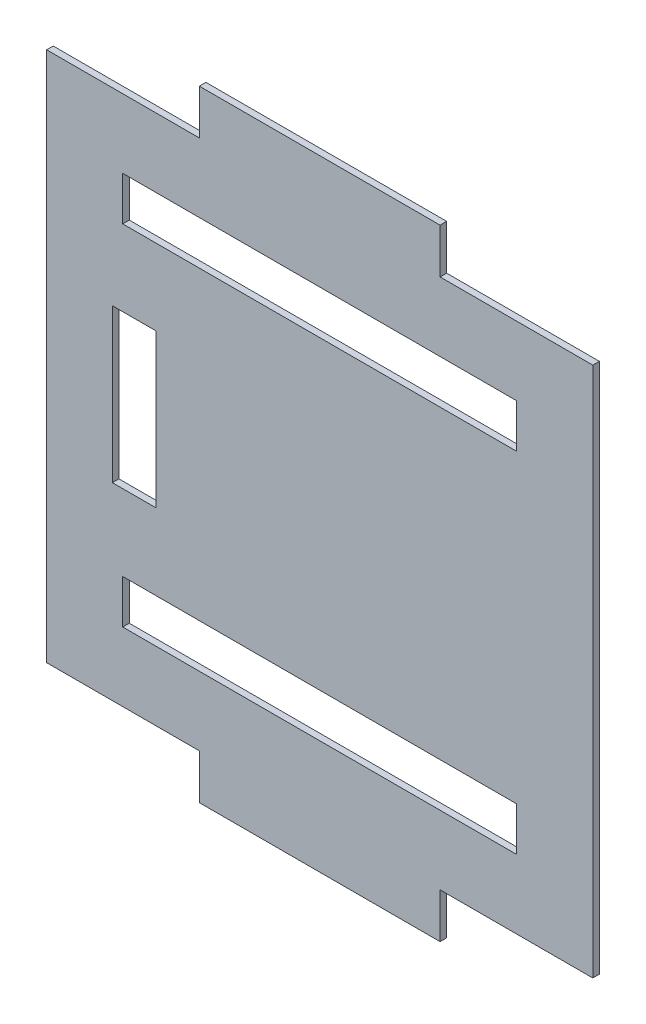
ISO-10303-21;
HEADER;
FILE_DESCRIPTION(('STEP AP214'),'2;1');
FILE_NAME('part.step','',(''),(''),'','','');
FILE_SCHEMA(('AUTOMOTIVE_DESIGN { 1 0 10303 214 1 1 1 1 }'));
ENDSEC;
DATA;
#1=APPLICATION_CONTEXT('core data for automotive mechanical design processes');
#2=APPLICATION_PROTOCOL_DEFINITION('international standard','automotive_design',2000,#1);
#3=PRODUCT_CONTEXT('',#1,'mechanical');
#4=PRODUCT('Part','Part','',(#3));
#5=PRODUCT_RELATED_PRODUCT_CATEGORY('part','',(#4));
#6=PRODUCT_DEFINITION_FORMATION('','',#4);
#7=PRODUCT_DEFINITION_CONTEXT('part definition',#1,'design');
#8=PRODUCT_DEFINITION('design','',#6,#7);
#9=PRODUCT_DEFINITION_SHAPE('','',#8);
#10=(LENGTH_UNIT() NAMED_UNIT(*) SI_UNIT(.MILLI.,.METRE.));
#11=(NAMED_UNIT(*) PLANE_ANGLE_UNIT() SI_UNIT($,.RADIAN.));
#12=(NAMED_UNIT(*) SI_UNIT($,.STERADIAN.) SOLID_ANGLE_UNIT());
#13=UNCERTAINTY_MEASURE_WITH_UNIT(LENGTH_MEASURE(1.E-05),#10,'distance_accuracy_value','');
#14=(GEOMETRIC_REPRESENTATION_CONTEXT(3) GLOBAL_UNCERTAINTY_ASSIGNED_CONTEXT((#13)) GLOBAL_UNIT_ASSIGNED_CONTEXT((#10,
#11,#12)) REPRESENTATION_CONTEXT('',''));
#15=CARTESIAN_POINT('',(0.,0.,0.));
#16=DIRECTION('',(0.,0.,1.));
#17=DIRECTION('',(1.,0.,0.));
#18=AXIS2_PLACEMENT_3D('',#15,#16,#17);
#19=CARTESIAN_POINT('',(24.7487373415291,284.748737341529,3.));
#20=DIRECTION('',(-1.,0.,0.));
#21=DIRECTION('',(0.,-1.,0.));
#22=AXIS2_PLACEMENT_3D('',#19,#20,#21);
#23=PLANE('',#22);
#24=DIRECTION('',(0.,1.,0.));
#25=VECTOR('',#24,1.);
#26=CARTESIAN_POINT('',(24.7487373415291,284.748737341529,0.));
#27=LINE('',#26,#25);
#28=CARTESIAN_POINT('',(24.7487373415291,33.5,0.));
#29=VERTEX_POINT('',#28);
#30=CARTESIAN_POINT('',(24.7487373415291,275.997474683058,0.));
#31=VERTEX_POINT('',#30);
#32=EDGE_CURVE('E334',#29,#31,#27,.T.);
#33=ORIENTED_EDGE('',*,*,#32,.T.);
#34=DIRECTION('',(0.,0.,1.));
#35=VECTOR('',#34,1.);
#36=CARTESIAN_POINT('',(24.7487373415291,275.997474683058,0.));
#37=LINE('',#36,#35);
#38=CARTESIAN_POINT('',(24.7487373415291,275.997474683058,3.));
#39=VERTEX_POINT('',#38);
#40=EDGE_CURVE('E335',#31,#39,#37,.T.);
#41=ORIENTED_EDGE('',*,*,#40,.T.);
#42=DIRECTION('',(0.,1.,0.));
#43=VECTOR('',#42,1.);
#44=CARTESIAN_POINT('',(24.7487373415291,284.748737341529,3.));
#45=LINE('',#44,#43);
#46=CARTESIAN_POINT('',(24.7487373415291,33.5,3.));
#47=VERTEX_POINT('',#46);
#48=EDGE_CURVE('E45',#47,#39,#45,.T.);
#49=ORIENTED_EDGE('',*,*,#48,.F.);
#50=DIRECTION('',(0.,0.,1.));
#51=VECTOR('',#50,1.);
#52=CARTESIAN_POINT('',(24.7487373415291,33.5,0.));
#53=LINE('',#52,#51);
#54=EDGE_CURVE('E345',#29,#47,#53,.T.);
#55=ORIENTED_EDGE('',*,*,#54,.F.);
#56=EDGE_LOOP('',(#33,#41,#49,#55));
#57=FACE_BOUND('',#56,.T.);
#58=ADVANCED_FACE('F37',(#57),#23,.F.);
#59=CARTESIAN_POINT('',(-224.748737341529,24.7487373415292,3.));
#60=DIRECTION('',(1.,0.,0.));
#61=DIRECTION('',(0.,1.,0.));
#62=AXIS2_PLACEMENT_3D('',#59,#60,#61);
#63=PLANE('',#62);
#64=DIRECTION('',(0.,-1.,0.));
#65=VECTOR('',#64,1.);
#66=CARTESIAN_POINT('',(-224.748737341529,24.7487373415292,3.));
#67=LINE('',#66,#65);
#68=CARTESIAN_POINT('',(-224.748737341529,275.997474683058,3.));
#69=VERTEX_POINT('',#68);
#70=CARTESIAN_POINT('',(-224.748737341529,33.5,3.));
#71=VERTEX_POINT('',#70);
#72=EDGE_CURVE('E11',#69,#71,#67,.T.);
#73=ORIENTED_EDGE('',*,*,#72,.F.);
#74=DIRECTION('',(0.,0.,1.));
#75=VECTOR('',#74,1.);
#76=CARTESIAN_POINT('',(-224.748737341529,275.997474683058,0.));
#77=LINE('',#76,#75);
#78=CARTESIAN_POINT('',(-224.748737341529,275.997474683058,0.));
#79=VERTEX_POINT('',#78);
#80=EDGE_CURVE('E332',#79,#69,#77,.T.);
#81=ORIENTED_EDGE('',*,*,#80,.F.);
#82=DIRECTION('',(0.,-1.,0.));
#83=VECTOR('',#82,1.);
#84=CARTESIAN_POINT('',(-224.748737341529,24.7487373415292,0.));
#85=LINE('',#84,#83);
#86=CARTESIAN_POINT('',(-224.748737341529,33.5,0.));
#87=VERTEX_POINT('',#86);
#88=EDGE_CURVE('E40',#79,#87,#85,.T.);
#89=ORIENTED_EDGE('',*,*,#88,.T.);
#90=DIRECTION('',(0.,0.,1.));
#91=VECTOR('',#90,1.);
#92=CARTESIAN_POINT('',(-224.748737341529,33.5,0.));
#93=LINE('',#92,#91);
#94=EDGE_CURVE('E235',#87,#71,#93,.T.);
#95=ORIENTED_EDGE('',*,*,#94,.T.);
#96=EDGE_LOOP('',(#73,#81,#89,#95));
#97=FACE_BOUND('',#96,.T.);
#98=ADVANCED_FACE('F395',(#97),#63,.F.);
#99=CARTESIAN_POINT('',(0.,0.,3.));
#100=DIRECTION('',(0.,0.,-1.));
#101=DIRECTION('',(-1.,0.,0.));
#102=AXIS2_PLACEMENT_3D('',#99,#100,#101);
#103=PLANE('',#102);
#104=DIRECTION('',(1.,0.,0.));
#105=VECTOR('',#104,1.);
#106=CARTESIAN_POINT('',(-190.,224.497474683058,3.));
#107=LINE('',#106,#105);
#108=CARTESIAN_POINT('',(-190.,224.497474683058,3.));
#109=VERTEX_POINT('',#108);
#110=CARTESIAN_POINT('',(-10.0000000000001,224.497474683058,3.));
#111=VERTEX_POINT('',#110);
#112=EDGE_CURVE('E229',#109,#111,#107,.T.);
#113=ORIENTED_EDGE('',*,*,#112,.F.);
#114=DIRECTION('',(0.,-1.,0.));
#115=VECTOR('',#114,1.);
#116=CARTESIAN_POINT('',(-190.,244.497474683058,3.));
#117=LINE('',#116,#115);
#118=CARTESIAN_POINT('',(-190.,244.497474683058,3.));
#119=VERTEX_POINT('',#118);
#120=EDGE_CURVE('E53',#119,#109,#117,.T.);
#121=ORIENTED_EDGE('',*,*,#120,.F.);
#122=DIRECTION('',(-1.,0.,0.));
#123=VECTOR('',#122,1.);
#124=CARTESIAN_POINT('',(-190.,244.497474683058,3.));
#125=LINE('',#124,#123);
#126=CARTESIAN_POINT('',(-10.,244.497474683058,3.));
#127=VERTEX_POINT('',#126);
#128=EDGE_CURVE('E220',#127,#119,#125,.T.);
#129=ORIENTED_EDGE('',*,*,#128,.F.);
#130=DIRECTION('',(0.,1.,0.));
#131=VECTOR('',#130,1.);
#132=CARTESIAN_POINT('',(-10.,244.497474683058,3.));
#133=LINE('',#132,#131);
#134=EDGE_CURVE('E223',#111,#127,#133,.T.);
#135=ORIENTED_EDGE('',*,*,#134,.F.);
#136=EDGE_LOOP('',(#113,#121,#129,#135));
#137=FACE_BOUND('',#136,.T.);
#138=DIRECTION('',(1.,0.,0.));
#139=VECTOR('',#138,1.);
#140=CARTESIAN_POINT('',(-194.748737341529,119.748737341529,3.));
#141=LINE('',#140,#139);
#142=CARTESIAN_POINT('',(-194.748737341529,119.748737341529,3.));
#143=VERTEX_POINT('',#142);
#144=CARTESIAN_POINT('',(-174.748737341529,119.748737341529,3.));
#145=VERTEX_POINT('',#144);
#146=EDGE_CURVE('E256',#143,#145,#141,.T.);
#147=ORIENTED_EDGE('',*,*,#146,.F.);
#148=DIRECTION('',(0.,-1.,0.));
#149=VECTOR('',#148,1.);
#150=CARTESIAN_POINT('',(-194.748737341529,189.748737341529,3.));
#151=LINE('',#150,#149);
#152=CARTESIAN_POINT('',(-194.748737341529,189.748737341529,3.));
#153=VERTEX_POINT('',#152);
#154=EDGE_CURVE('E61',#153,#143,#151,.T.);
#155=ORIENTED_EDGE('',*,*,#154,.F.);
#156=DIRECTION('',(-1.,0.,0.));
#157=VECTOR('',#156,1.);
#158=CARTESIAN_POINT('',(-194.748737341529,189.748737341529,3.));
#159=LINE('',#158,#157);
#160=CARTESIAN_POINT('',(-174.748737341529,189.748737341529,3.));
#161=VERTEX_POINT('',#160);
#162=EDGE_CURVE('E249',#161,#153,#159,.T.);
#163=ORIENTED_EDGE('',*,*,#162,.F.);
#164=DIRECTION('',(0.,1.,0.));
#165=VECTOR('',#164,1.);
#166=CARTESIAN_POINT('',(-174.748737341529,189.748737341529,3.));
#167=LINE('',#166,#165);
#168=EDGE_CURVE('E252',#145,#161,#167,.T.);
#169=ORIENTED_EDGE('',*,*,#168,.F.);
#170=EDGE_LOOP('',(#147,#155,#163,#169));
#171=FACE_BOUND('',#170,.T.);
#172=DIRECTION('',(0.,1.,0.));
#173=VECTOR('',#172,1.);
#174=CARTESIAN_POINT('',(-10.,65.0000000000001,3.));
#175=LINE('',#174,#173);
#176=CARTESIAN_POINT('',(-10.,65.0000000000001,3.));
#177=VERTEX_POINT('',#176);
#178=CARTESIAN_POINT('',(-10.,85.,3.));
#179=VERTEX_POINT('',#178);
#180=EDGE_CURVE('E287',#177,#179,#175,.T.);
#181=ORIENTED_EDGE('',*,*,#180,.F.);
#182=DIRECTION('',(1.,0.,0.));
#183=VECTOR('',#182,1.);
#184=CARTESIAN_POINT('',(-190.,65.,3.));
#185=LINE('',#184,#183);
#186=CARTESIAN_POINT('',(-190.,65.,3.));
#187=VERTEX_POINT('',#186);
#188=EDGE_CURVE('E248',#187,#177,#185,.T.);
#189=ORIENTED_EDGE('',*,*,#188,.F.);
#190=DIRECTION('',(0.,-1.,0.));
#191=VECTOR('',#190,1.);
#192=CARTESIAN_POINT('',(-190.,65.,3.));
#193=LINE('',#192,#191);
#194=CARTESIAN_POINT('',(-190.,85.,3.));
#195=VERTEX_POINT('',#194);
#196=EDGE_CURVE('E280',#195,#187,#193,.T.);
#197=ORIENTED_EDGE('',*,*,#196,.F.);
#198=DIRECTION('',(-1.,0.,0.));
#199=VECTOR('',#198,1.);
#200=CARTESIAN_POINT('',(-190.,85.,3.));
#201=LINE('',#200,#199);
#202=EDGE_CURVE('E283',#179,#195,#201,.T.);
#203=ORIENTED_EDGE('',*,*,#202,.F.);
#204=EDGE_LOOP('',(#181,#189,#197,#203));
#205=FACE_BOUND('',#204,.T.);
#206=DIRECTION('',(0.,1.,0.));
#207=VECTOR('',#206,1.);
#208=CARTESIAN_POINT('',(-155.,275.997474683058,3.));
#209=LINE('',#208,#207);
#210=CARTESIAN_POINT('',(-155.,275.997474683058,3.));
#211=VERTEX_POINT('',#210);
#212=CARTESIAN_POINT('',(-155.,296.497474683058,3.));
#213=VERTEX_POINT('',#212);
#214=EDGE_CURVE('E321',#211,#213,#209,.T.);
#215=ORIENTED_EDGE('',*,*,#214,.F.);
#216=DIRECTION('',(1.,0.,0.));
#217=VECTOR('',#216,1.);
#218=CARTESIAN_POINT('',(-224.748737341529,275.997474683058,3.));
#219=LINE('',#218,#217);
#220=EDGE_CURVE('E318',#69,#211,#219,.T.);
#221=ORIENTED_EDGE('',*,*,#220,.F.);
#222=ORIENTED_EDGE('',*,*,#72,.T.);
#223=DIRECTION('',(-1.,0.,0.));
#224=VECTOR('',#223,1.);
#225=CARTESIAN_POINT('',(-224.748737341529,33.5,3.));
#226=LINE('',#225,#224);
#227=CARTESIAN_POINT('',(-155.,33.5,3.));
#228=VERTEX_POINT('',#227);
#229=EDGE_CURVE('E358',#228,#71,#226,.T.);
#230=ORIENTED_EDGE('',*,*,#229,.F.);
#231=DIRECTION('',(0.,1.,0.));
#232=VECTOR('',#231,1.);
#233=CARTESIAN_POINT('',(-155.,33.5,3.));
#234=LINE('',#233,#232);
#235=CARTESIAN_POINT('',(-155.,13.0000000000001,3.));
#236=VERTEX_POINT('',#235);
#237=EDGE_CURVE('E360',#236,#228,#234,.T.);
#238=ORIENTED_EDGE('',*,*,#237,.F.);
#239=DIRECTION('',(-1.,0.,0.));
#240=VECTOR('',#239,1.);
#241=CARTESIAN_POINT('',(-45.,13.0000000000001,3.));
#242=LINE('',#241,#240);
#243=CARTESIAN_POINT('',(-45.,13.0000000000001,3.));
#244=VERTEX_POINT('',#243);
#245=EDGE_CURVE('E364',#244,#236,#242,.T.);
#246=ORIENTED_EDGE('',*,*,#245,.F.);
#247=DIRECTION('',(0.,-1.,0.));
#248=VECTOR('',#247,1.);
#249=CARTESIAN_POINT('',(-45.,13.0000000000001,3.));
#250=LINE('',#249,#248);
#251=CARTESIAN_POINT('',(-45.,33.5,3.));
#252=VERTEX_POINT('',#251);
#253=EDGE_CURVE('E367',#252,#244,#250,.T.);
#254=ORIENTED_EDGE('',*,*,#253,.F.);
#255=DIRECTION('',(-1.,0.,0.));
#256=VECTOR('',#255,1.);
#257=CARTESIAN_POINT('',(-45.,33.5,3.));
#258=LINE('',#257,#256);
#259=EDGE_CURVE('E322',#47,#252,#258,.T.);
#260=ORIENTED_EDGE('',*,*,#259,.F.);
#261=ORIENTED_EDGE('',*,*,#48,.T.);
#262=DIRECTION('',(1.,0.,0.));
#263=VECTOR('',#262,1.);
#264=CARTESIAN_POINT('',(-45.,275.997474683058,3.));
#265=LINE('',#264,#263);
#266=CARTESIAN_POINT('',(-45.,275.997474683058,3.));
#267=VERTEX_POINT('',#266);
#268=EDGE_CURVE('E305',#267,#39,#265,.T.);
#269=ORIENTED_EDGE('',*,*,#268,.F.);
#270=DIRECTION('',(0.,-1.,0.));
#271=VECTOR('',#270,1.);
#272=CARTESIAN_POINT('',(-45.,296.497474683058,3.));
#273=LINE('',#272,#271);
#274=CARTESIAN_POINT('',(-45.,296.497474683058,3.));
#275=VERTEX_POINT('',#274);
#276=EDGE_CURVE('E328',#275,#267,#273,.T.);
#277=ORIENTED_EDGE('',*,*,#276,.F.);
#278=DIRECTION('',(1.,0.,0.));
#279=VECTOR('',#278,1.);
#280=CARTESIAN_POINT('',(-45.,296.497474683058,3.));
#281=LINE('',#280,#279);
#282=EDGE_CURVE('E325',#213,#275,#281,.T.);
#283=ORIENTED_EDGE('',*,*,#282,.F.);
#284=EDGE_LOOP('',(#215,#221,#222,#230,#238,#246,#254,#260,#261,#269,#277,#283));
#285=FACE_BOUND('',#284,.T.);
#286=ADVANCED_FACE('F405',(#137,#171,#205,#285),#103,.F.);
#287=CARTESIAN_POINT('',(0.,0.,0.));
#288=DIRECTION('',(0.,0.,-1.));
#289=DIRECTION('',(-1.,0.,0.));
#290=AXIS2_PLACEMENT_3D('',#287,#288,#289);
#291=PLANE('',#290);
#292=DIRECTION('',(0.,-1.,0.));
#293=VECTOR('',#292,1.);
#294=CARTESIAN_POINT('',(-190.,244.497474683058,0.));
#295=LINE('',#294,#293);
#296=CARTESIAN_POINT('',(-190.,244.497474683058,0.));
#297=VERTEX_POINT('',#296);
#298=CARTESIAN_POINT('',(-190.,224.497474683058,0.));
#299=VERTEX_POINT('',#298);
#300=EDGE_CURVE('E201',#297,#299,#295,.T.);
#301=ORIENTED_EDGE('',*,*,#300,.T.);
#302=DIRECTION('',(1.,0.,0.));
#303=VECTOR('',#302,1.);
#304=CARTESIAN_POINT('',(-190.,224.497474683058,0.));
#305=LINE('',#304,#303);
#306=CARTESIAN_POINT('',(-10.0000000000001,224.497474683058,0.));
#307=VERTEX_POINT('',#306);
#308=EDGE_CURVE('E211',#299,#307,#305,.T.);
#309=ORIENTED_EDGE('',*,*,#308,.T.);
#310=DIRECTION('',(0.,1.,0.));
#311=VECTOR('',#310,1.);
#312=CARTESIAN_POINT('',(-10.,244.497474683058,0.));
#313=LINE('',#312,#311);
#314=CARTESIAN_POINT('',(-10.,244.497474683058,0.));
#315=VERTEX_POINT('',#314);
#316=EDGE_CURVE('E215',#307,#315,#313,.T.);
#317=ORIENTED_EDGE('',*,*,#316,.T.);
#318=DIRECTION('',(-1.,0.,0.));
#319=VECTOR('',#318,1.);
#320=CARTESIAN_POINT('',(-190.,244.497474683058,0.));
#321=LINE('',#320,#319);
#322=EDGE_CURVE('E207',#315,#297,#321,.T.);
#323=ORIENTED_EDGE('',*,*,#322,.T.);
#324=EDGE_LOOP('',(#301,#309,#317,#323));
#325=FACE_BOUND('',#324,.T.);
#326=DIRECTION('',(0.,-1.,0.));
#327=VECTOR('',#326,1.);
#328=CARTESIAN_POINT('',(-194.748737341529,189.748737341529,0.));
#329=LINE('',#328,#327);
#330=CARTESIAN_POINT('',(-194.748737341529,189.748737341529,0.));
#331=VERTEX_POINT('',#330);
#332=CARTESIAN_POINT('',(-194.748737341529,119.748737341529,0.));
#333=VERTEX_POINT('',#332);
#334=EDGE_CURVE('E253',#331,#333,#329,.T.);
#335=ORIENTED_EDGE('',*,*,#334,.T.);
#336=DIRECTION('',(1.,0.,0.));
#337=VECTOR('',#336,1.);
#338=CARTESIAN_POINT('',(-194.748737341529,119.748737341529,0.));
#339=LINE('',#338,#337);
#340=CARTESIAN_POINT('',(-174.748737341529,119.748737341529,0.));
#341=VERTEX_POINT('',#340);
#342=EDGE_CURVE('E265',#333,#341,#339,.T.);
#343=ORIENTED_EDGE('',*,*,#342,.T.);
#344=DIRECTION('',(0.,1.,0.));
#345=VECTOR('',#344,1.);
#346=CARTESIAN_POINT('',(-174.748737341529,189.748737341529,0.));
#347=LINE('',#346,#345);
#348=CARTESIAN_POINT('',(-174.748737341529,189.748737341529,0.));
#349=VERTEX_POINT('',#348);
#350=EDGE_CURVE('E262',#341,#349,#347,.T.);
#351=ORIENTED_EDGE('',*,*,#350,.T.);
#352=DIRECTION('',(-1.,0.,0.));
#353=VECTOR('',#352,1.);
#354=CARTESIAN_POINT('',(-194.748737341529,189.748737341529,0.));
#355=LINE('',#354,#353);
#356=EDGE_CURVE('E241',#349,#331,#355,.T.);
#357=ORIENTED_EDGE('',*,*,#356,.T.);
#358=EDGE_LOOP('',(#335,#343,#351,#357));
#359=FACE_BOUND('',#358,.T.);
#360=DIRECTION('',(1.,0.,0.));
#361=VECTOR('',#360,1.);
#362=CARTESIAN_POINT('',(-190.,65.,0.));
#363=LINE('',#362,#361);
#364=CARTESIAN_POINT('',(-190.,65.,0.));
#365=VERTEX_POINT('',#364);
#366=CARTESIAN_POINT('',(-10.,65.0000000000001,0.));
#367=VERTEX_POINT('',#366);
#368=EDGE_CURVE('E284',#365,#367,#363,.T.);
#369=ORIENTED_EDGE('',*,*,#368,.T.);
#370=DIRECTION('',(0.,1.,0.));
#371=VECTOR('',#370,1.);
#372=CARTESIAN_POINT('',(-10.,65.0000000000001,0.));
#373=LINE('',#372,#371);
#374=CARTESIAN_POINT('',(-10.,85.,0.));
#375=VERTEX_POINT('',#374);
#376=EDGE_CURVE('E296',#367,#375,#373,.T.);
#377=ORIENTED_EDGE('',*,*,#376,.T.);
#378=DIRECTION('',(-1.,0.,0.));
#379=VECTOR('',#378,1.);
#380=CARTESIAN_POINT('',(-190.,85.,0.));
#381=LINE('',#380,#379);
#382=CARTESIAN_POINT('',(-190.,85.,0.));
#383=VERTEX_POINT('',#382);
#384=EDGE_CURVE('E293',#375,#383,#381,.T.);
#385=ORIENTED_EDGE('',*,*,#384,.T.);
#386=DIRECTION('',(0.,-1.,0.));
#387=VECTOR('',#386,1.);
#388=CARTESIAN_POINT('',(-190.,65.,0.));
#389=LINE('',#388,#387);
#390=EDGE_CURVE('E273',#383,#365,#389,.T.);
#391=ORIENTED_EDGE('',*,*,#390,.T.);
#392=EDGE_LOOP('',(#369,#377,#385,#391));
#393=FACE_BOUND('',#392,.T.);
#394=DIRECTION('',(1.,0.,0.));
#395=VECTOR('',#394,1.);
#396=CARTESIAN_POINT('',(-224.748737341529,275.997474683058,0.));
#397=LINE('',#396,#395);
#398=CARTESIAN_POINT('',(-155.,275.997474683058,0.));
#399=VERTEX_POINT('',#398);
#400=EDGE_CURVE('E301',#79,#399,#397,.T.);
#401=ORIENTED_EDGE('',*,*,#400,.T.);
#402=DIRECTION('',(0.,1.,0.));
#403=VECTOR('',#402,1.);
#404=CARTESIAN_POINT('',(-155.,275.997474683058,0.));
#405=LINE('',#404,#403);
#406=CARTESIAN_POINT('',(-155.,296.497474683058,0.));
#407=VERTEX_POINT('',#406);
#408=EDGE_CURVE('E304',#399,#407,#405,.T.);
#409=ORIENTED_EDGE('',*,*,#408,.T.);
#410=DIRECTION('',(1.,0.,0.));
#411=VECTOR('',#410,1.);
#412=CARTESIAN_POINT('',(-45.,296.497474683058,0.));
#413=LINE('',#412,#411);
#414=CARTESIAN_POINT('',(-45.,296.497474683058,0.));
#415=VERTEX_POINT('',#414);
#416=EDGE_CURVE('E308',#407,#415,#413,.T.);
#417=ORIENTED_EDGE('',*,*,#416,.T.);
#418=DIRECTION('',(0.,-1.,0.));
#419=VECTOR('',#418,1.);
#420=CARTESIAN_POINT('',(-45.,296.497474683058,0.));
#421=LINE('',#420,#419);
#422=CARTESIAN_POINT('',(-45.,275.997474683058,0.));
#423=VERTEX_POINT('',#422);
#424=EDGE_CURVE('E311',#415,#423,#421,.T.);
#425=ORIENTED_EDGE('',*,*,#424,.T.);
#426=DIRECTION('',(1.,0.,0.));
#427=VECTOR('',#426,1.);
#428=CARTESIAN_POINT('',(-45.,275.997474683058,0.));
#429=LINE('',#428,#427);
#430=EDGE_CURVE('E314',#423,#31,#429,.T.);
#431=ORIENTED_EDGE('',*,*,#430,.T.);
#432=ORIENTED_EDGE('',*,*,#32,.F.);
#433=DIRECTION('',(-1.,0.,0.));
#434=VECTOR('',#433,1.);
#435=CARTESIAN_POINT('',(-45.,33.5,0.));
#436=LINE('',#435,#434);
#437=CARTESIAN_POINT('',(-45.,33.5,0.));
#438=VERTEX_POINT('',#437);
#439=EDGE_CURVE('E361',#29,#438,#436,.T.);
#440=ORIENTED_EDGE('',*,*,#439,.T.);
#441=DIRECTION('',(0.,-1.,0.));
#442=VECTOR('',#441,1.);
#443=CARTESIAN_POINT('',(-45.,13.0000000000001,0.));
#444=LINE('',#443,#442);
#445=CARTESIAN_POINT('',(-45.,13.0000000000001,0.));
#446=VERTEX_POINT('',#445);
#447=EDGE_CURVE('E380',#438,#446,#444,.T.);
#448=ORIENTED_EDGE('',*,*,#447,.T.);
#449=DIRECTION('',(-1.,0.,0.));
#450=VECTOR('',#449,1.);
#451=CARTESIAN_POINT('',(-45.,13.0000000000001,0.));
#452=LINE('',#451,#450);
#453=CARTESIAN_POINT('',(-155.,13.0000000000001,0.));
#454=VERTEX_POINT('',#453);
#455=EDGE_CURVE('E377',#446,#454,#452,.T.);
#456=ORIENTED_EDGE('',*,*,#455,.T.);
#457=DIRECTION('',(0.,1.,0.));
#458=VECTOR('',#457,1.);
#459=CARTESIAN_POINT('',(-155.,33.5,0.));
#460=LINE('',#459,#458);
#461=CARTESIAN_POINT('',(-155.,33.5,0.));
#462=VERTEX_POINT('',#461);
#463=EDGE_CURVE('E374',#454,#462,#460,.T.);
#464=ORIENTED_EDGE('',*,*,#463,.T.);
#465=DIRECTION('',(-1.,0.,0.));
#466=VECTOR('',#465,1.);
#467=CARTESIAN_POINT('',(-224.748737341529,33.5,0.));
#468=LINE('',#467,#466);
#469=EDGE_CURVE('E347',#462,#87,#468,.T.);
#470=ORIENTED_EDGE('',*,*,#469,.T.);
#471=ORIENTED_EDGE('',*,*,#88,.F.);
#472=EDGE_LOOP('',(#401,#409,#417,#425,#431,#432,#440,#448,#456,#464,#470,#471));
#473=FACE_BOUND('',#472,.T.);
#474=ADVANCED_FACE('F217',(#325,#359,#393,#473),#291,.T.);
#475=CARTESIAN_POINT('',(-224.748737341529,33.5,0.));
#476=DIRECTION('',(0.,1.,0.));
#477=DIRECTION('',(0.,0.,1.));
#478=AXIS2_PLACEMENT_3D('',#475,#476,#477);
#479=PLANE('',#478);
#480=ORIENTED_EDGE('',*,*,#229,.T.);
#481=ORIENTED_EDGE('',*,*,#94,.F.);
#482=ORIENTED_EDGE('',*,*,#469,.F.);
#483=DIRECTION('',(0.,0.,1.));
#484=VECTOR('',#483,1.);
#485=CARTESIAN_POINT('',(-155.,33.5,0.));
#486=LINE('',#485,#484);
#487=EDGE_CURVE('E354',#462,#228,#486,.T.);
#488=ORIENTED_EDGE('',*,*,#487,.T.);
#489=EDGE_LOOP('',(#480,#481,#482,#488));
#490=FACE_BOUND('',#489,.T.);
#491=ADVANCED_FACE('F400',(#490),#479,.F.);
#492=CARTESIAN_POINT('',(-155.,33.5,0.));
#493=DIRECTION('',(1.,0.,0.));
#494=DIRECTION('',(0.,1.,0.));
#495=AXIS2_PLACEMENT_3D('',#492,#493,#494);
#496=PLANE('',#495);
#497=ORIENTED_EDGE('',*,*,#237,.T.);
#498=ORIENTED_EDGE('',*,*,#487,.F.);
#499=ORIENTED_EDGE('',*,*,#463,.F.);
#500=DIRECTION('',(0.,0.,1.));
#501=VECTOR('',#500,1.);
#502=CARTESIAN_POINT('',(-155.,13.0000000000001,0.));
#503=LINE('',#502,#501);
#504=EDGE_CURVE('E352',#454,#236,#503,.T.);
#505=ORIENTED_EDGE('',*,*,#504,.T.);
#506=EDGE_LOOP('',(#497,#498,#499,#505));
#507=FACE_BOUND('',#506,.T.);
#508=ADVANCED_FACE('F437',(#507),#496,.F.);
#509=CARTESIAN_POINT('',(-45.,13.0000000000001,0.));
#510=DIRECTION('',(0.,1.,0.));
#511=DIRECTION('',(-1.,0.,0.));
#512=AXIS2_PLACEMENT_3D('',#509,#510,#511);
#513=PLANE('',#512);
#514=ORIENTED_EDGE('',*,*,#245,.T.);
#515=ORIENTED_EDGE('',*,*,#504,.F.);
#516=ORIENTED_EDGE('',*,*,#455,.F.);
#517=DIRECTION('',(0.,0.,1.));
#518=VECTOR('',#517,1.);
#519=CARTESIAN_POINT('',(-45.,13.0000000000001,0.));
#520=LINE('',#519,#518);
#521=EDGE_CURVE('E350',#446,#244,#520,.T.);
#522=ORIENTED_EDGE('',*,*,#521,.T.);
#523=EDGE_LOOP('',(#514,#515,#516,#522));
#524=FACE_BOUND('',#523,.T.);
#525=ADVANCED_FACE('F435',(#524),#513,.F.);
#526=CARTESIAN_POINT('',(-45.,13.0000000000001,0.));
#527=DIRECTION('',(-1.,0.,0.));
#528=DIRECTION('',(0.,-1.,0.));
#529=AXIS2_PLACEMENT_3D('',#526,#527,#528);
#530=PLANE('',#529);
#531=ORIENTED_EDGE('',*,*,#253,.T.);
#532=ORIENTED_EDGE('',*,*,#521,.F.);
#533=ORIENTED_EDGE('',*,*,#447,.F.);
#534=DIRECTION('',(0.,0.,1.));
#535=VECTOR('',#534,1.);
#536=CARTESIAN_POINT('',(-45.,33.5,0.));
#537=LINE('',#536,#535);
#538=EDGE_CURVE('E348',#438,#252,#537,.T.);
#539=ORIENTED_EDGE('',*,*,#538,.T.);
#540=EDGE_LOOP('',(#531,#532,#533,#539));
#541=FACE_BOUND('',#540,.T.);
#542=ADVANCED_FACE('F432',(#541),#530,.F.);
#543=CARTESIAN_POINT('',(-45.,33.5,0.));
#544=DIRECTION('',(0.,1.,0.));
#545=DIRECTION('',(0.,0.,1.));
#546=AXIS2_PLACEMENT_3D('',#543,#544,#545);
#547=PLANE('',#546);
#548=ORIENTED_EDGE('',*,*,#259,.T.);
#549=ORIENTED_EDGE('',*,*,#538,.F.);
#550=ORIENTED_EDGE('',*,*,#439,.F.);
#551=ORIENTED_EDGE('',*,*,#54,.T.);
#552=EDGE_LOOP('',(#548,#549,#550,#551));
#553=FACE_BOUND('',#552,.T.);
#554=ADVANCED_FACE('F427',(#553),#547,.F.);
#555=CARTESIAN_POINT('',(-224.748737341529,275.997474683058,0.));
#556=DIRECTION('',(0.,-1.,0.));
#557=DIRECTION('',(0.,0.,-1.));
#558=AXIS2_PLACEMENT_3D('',#555,#556,#557);
#559=PLANE('',#558);
#560=ORIENTED_EDGE('',*,*,#220,.T.);
#561=DIRECTION('',(0.,0.,1.));
#562=VECTOR('',#561,1.);
#563=CARTESIAN_POINT('',(-155.,275.997474683058,0.));
#564=LINE('',#563,#562);
#565=EDGE_CURVE('E317',#399,#211,#564,.T.);
#566=ORIENTED_EDGE('',*,*,#565,.F.);
#567=ORIENTED_EDGE('',*,*,#400,.F.);
#568=ORIENTED_EDGE('',*,*,#80,.T.);
#569=EDGE_LOOP('',(#560,#566,#567,#568));
#570=FACE_BOUND('',#569,.T.);
#571=ADVANCED_FACE('F410',(#570),#559,.F.);
#572=CARTESIAN_POINT('',(-45.,275.997474683058,0.));
#573=DIRECTION('',(0.,-1.,0.));
#574=DIRECTION('',(0.,0.,-1.));
#575=AXIS2_PLACEMENT_3D('',#572,#573,#574);
#576=PLANE('',#575);
#577=ORIENTED_EDGE('',*,*,#268,.T.);
#578=ORIENTED_EDGE('',*,*,#40,.F.);
#579=ORIENTED_EDGE('',*,*,#430,.F.);
#580=DIRECTION('',(0.,0.,1.));
#581=VECTOR('',#580,1.);
#582=CARTESIAN_POINT('',(-45.,275.997474683058,0.));
#583=LINE('',#582,#581);
#584=EDGE_CURVE('E338',#423,#267,#583,.T.);
#585=ORIENTED_EDGE('',*,*,#584,.T.);
#586=EDGE_LOOP('',(#577,#578,#579,#585));
#587=FACE_BOUND('',#586,.T.);
#588=ADVANCED_FACE('F424',(#587),#576,.F.);
#589=CARTESIAN_POINT('',(-45.,296.497474683058,0.));
#590=DIRECTION('',(-1.,0.,0.));
#591=DIRECTION('',(0.,-1.,0.));
#592=AXIS2_PLACEMENT_3D('',#589,#590,#591);
#593=PLANE('',#592);
#594=ORIENTED_EDGE('',*,*,#276,.T.);
#595=ORIENTED_EDGE('',*,*,#584,.F.);
#596=ORIENTED_EDGE('',*,*,#424,.F.);
#597=DIRECTION('',(0.,0.,1.));
#598=VECTOR('',#597,1.);
#599=CARTESIAN_POINT('',(-45.,296.497474683058,0.));
#600=LINE('',#599,#598);
#601=EDGE_CURVE('E340',#415,#275,#600,.T.);
#602=ORIENTED_EDGE('',*,*,#601,.T.);
#603=EDGE_LOOP('',(#594,#595,#596,#602));
#604=FACE_BOUND('',#603,.T.);
#605=ADVANCED_FACE('F420',(#604),#593,.F.);
#606=CARTESIAN_POINT('',(-45.,296.497474683058,0.));
#607=DIRECTION('',(0.,-1.,0.));
#608=DIRECTION('',(0.,0.,-1.));
#609=AXIS2_PLACEMENT_3D('',#606,#607,#608);
#610=PLANE('',#609);
#611=ORIENTED_EDGE('',*,*,#282,.T.);
#612=ORIENTED_EDGE('',*,*,#601,.F.);
#613=ORIENTED_EDGE('',*,*,#416,.F.);
#614=DIRECTION('',(0.,0.,1.));
#615=VECTOR('',#614,1.);
#616=CARTESIAN_POINT('',(-155.,296.497474683058,0.));
#617=LINE('',#616,#615);
#618=EDGE_CURVE('E342',#407,#213,#617,.T.);
#619=ORIENTED_EDGE('',*,*,#618,.T.);
#620=EDGE_LOOP('',(#611,#612,#613,#619));
#621=FACE_BOUND('',#620,.T.);
#622=ADVANCED_FACE('F417',(#621),#610,.F.);
#623=CARTESIAN_POINT('',(-155.,275.997474683058,0.));
#624=DIRECTION('',(1.,0.,0.));
#625=DIRECTION('',(0.,1.,0.));
#626=AXIS2_PLACEMENT_3D('',#623,#624,#625);
#627=PLANE('',#626);
#628=ORIENTED_EDGE('',*,*,#214,.T.);
#629=ORIENTED_EDGE('',*,*,#618,.F.);
#630=ORIENTED_EDGE('',*,*,#408,.F.);
#631=ORIENTED_EDGE('',*,*,#565,.T.);
#632=EDGE_LOOP('',(#628,#629,#630,#631));
#633=FACE_BOUND('',#632,.T.);
#634=ADVANCED_FACE('F414',(#633),#627,.F.);
#635=CARTESIAN_POINT('',(-190.,65.,0.));
#636=DIRECTION('',(0.,-1.,0.));
#637=DIRECTION('',(1.,0.,0.));
#638=AXIS2_PLACEMENT_3D('',#635,#636,#637);
#639=PLANE('',#638);
#640=ORIENTED_EDGE('',*,*,#188,.T.);
#641=DIRECTION('',(0.,0.,1.));
#642=VECTOR('',#641,1.);
#643=CARTESIAN_POINT('',(-10.,65.0000000000001,0.));
#644=LINE('',#643,#642);
#645=EDGE_CURVE('E270',#367,#177,#644,.T.);
#646=ORIENTED_EDGE('',*,*,#645,.F.);
#647=ORIENTED_EDGE('',*,*,#368,.F.);
#648=DIRECTION('',(0.,0.,1.));
#649=VECTOR('',#648,1.);
#650=CARTESIAN_POINT('',(-190.,65.,0.));
#651=LINE('',#650,#649);
#652=EDGE_CURVE('E278',#365,#187,#651,.T.);
#653=ORIENTED_EDGE('',*,*,#652,.T.);
#654=EDGE_LOOP('',(#640,#646,#647,#653));
#655=FACE_BOUND('',#654,.T.);
#656=ADVANCED_FACE('F543',(#655),#639,.F.);
#657=CARTESIAN_POINT('',(-190.,65.,0.));
#658=DIRECTION('',(-1.,0.,0.));
#659=DIRECTION('',(0.,-1.,0.));
#660=AXIS2_PLACEMENT_3D('',#657,#658,#659);
#661=PLANE('',#660);
#662=ORIENTED_EDGE('',*,*,#196,.T.);
#663=ORIENTED_EDGE('',*,*,#652,.F.);
#664=ORIENTED_EDGE('',*,*,#390,.F.);
#665=DIRECTION('',(0.,0.,1.));
#666=VECTOR('',#665,1.);
#667=CARTESIAN_POINT('',(-190.,85.,0.));
#668=LINE('',#667,#666);
#669=EDGE_CURVE('E276',#383,#195,#668,.T.);
#670=ORIENTED_EDGE('',*,*,#669,.T.);
#671=EDGE_LOOP('',(#662,#663,#664,#670));
#672=FACE_BOUND('',#671,.T.);
#673=ADVANCED_FACE('F578',(#672),#661,.F.);
#674=CARTESIAN_POINT('',(-190.,85.,0.));
#675=DIRECTION('',(0.,1.,0.));
#676=DIRECTION('',(-1.,0.,0.));
#677=AXIS2_PLACEMENT_3D('',#674,#675,#676);
#678=PLANE('',#677);
#679=ORIENTED_EDGE('',*,*,#202,.T.);
#680=ORIENTED_EDGE('',*,*,#669,.F.);
#681=ORIENTED_EDGE('',*,*,#384,.F.);
#682=DIRECTION('',(0.,0.,1.));
#683=VECTOR('',#682,1.);
#684=CARTESIAN_POINT('',(-10.,85.,0.));
#685=LINE('',#684,#683);
#686=EDGE_CURVE('E274',#375,#179,#685,.T.);
#687=ORIENTED_EDGE('',*,*,#686,.T.);
#688=EDGE_LOOP('',(#679,#680,#681,#687));
#689=FACE_BOUND('',#688,.T.);
#690=ADVANCED_FACE('F587',(#689),#678,.F.);
#691=CARTESIAN_POINT('',(-10.,65.0000000000001,0.));
#692=DIRECTION('',(1.,0.,0.));
#693=DIRECTION('',(0.,1.,0.));
#694=AXIS2_PLACEMENT_3D('',#691,#692,#693);
#695=PLANE('',#694);
#696=ORIENTED_EDGE('',*,*,#180,.T.);
#697=ORIENTED_EDGE('',*,*,#686,.F.);
#698=ORIENTED_EDGE('',*,*,#376,.F.);
#699=ORIENTED_EDGE('',*,*,#645,.T.);
#700=EDGE_LOOP('',(#696,#697,#698,#699));
#701=FACE_BOUND('',#700,.T.);
#702=ADVANCED_FACE('F597',(#701),#695,.F.);
#703=CARTESIAN_POINT('',(-194.748737341529,189.748737341529,0.));
#704=DIRECTION('',(-1.,0.,0.));
#705=DIRECTION('',(0.,0.,1.));
#706=AXIS2_PLACEMENT_3D('',#703,#704,#705);
#707=PLANE('',#706);
#708=ORIENTED_EDGE('',*,*,#154,.T.);
#709=DIRECTION('',(0.,0.,1.));
#710=VECTOR('',#709,1.);
#711=CARTESIAN_POINT('',(-194.748737341529,119.748737341529,0.));
#712=LINE('',#711,#710);
#713=EDGE_CURVE('E239',#333,#143,#712,.T.);
#714=ORIENTED_EDGE('',*,*,#713,.F.);
#715=ORIENTED_EDGE('',*,*,#334,.F.);
#716=DIRECTION('',(0.,0.,1.));
#717=VECTOR('',#716,1.);
#718=CARTESIAN_POINT('',(-194.748737341529,189.748737341529,0.));
#719=LINE('',#718,#717);
#720=EDGE_CURVE('E246',#331,#153,#719,.T.);
#721=ORIENTED_EDGE('',*,*,#720,.T.);
#722=EDGE_LOOP('',(#708,#714,#715,#721));
#723=FACE_BOUND('',#722,.T.);
#724=ADVANCED_FACE('F607',(#723),#707,.F.);
#725=CARTESIAN_POINT('',(-194.748737341529,189.748737341529,0.));
#726=DIRECTION('',(0.,1.,0.));
#727=DIRECTION('',(0.,0.,1.));
#728=AXIS2_PLACEMENT_3D('',#725,#726,#727);
#729=PLANE('',#728);
#730=ORIENTED_EDGE('',*,*,#162,.T.);
#731=ORIENTED_EDGE('',*,*,#720,.F.);
#732=ORIENTED_EDGE('',*,*,#356,.F.);
#733=DIRECTION('',(0.,0.,1.));
#734=VECTOR('',#733,1.);
#735=CARTESIAN_POINT('',(-174.748737341529,189.748737341529,0.));
#736=LINE('',#735,#734);
#737=EDGE_CURVE('E244',#349,#161,#736,.T.);
#738=ORIENTED_EDGE('',*,*,#737,.T.);
#739=EDGE_LOOP('',(#730,#731,#732,#738));
#740=FACE_BOUND('',#739,.T.);
#741=ADVANCED_FACE('F617',(#740),#729,.F.);
#742=CARTESIAN_POINT('',(-174.748737341529,189.748737341529,0.));
#743=DIRECTION('',(1.,0.,0.));
#744=DIRECTION('',(0.,0.,-1.));
#745=AXIS2_PLACEMENT_3D('',#742,#743,#744);
#746=PLANE('',#745);
#747=ORIENTED_EDGE('',*,*,#168,.T.);
#748=ORIENTED_EDGE('',*,*,#737,.F.);
#749=ORIENTED_EDGE('',*,*,#350,.F.);
#750=DIRECTION('',(0.,0.,1.));
#751=VECTOR('',#750,1.);
#752=CARTESIAN_POINT('',(-174.748737341529,119.748737341529,0.));
#753=LINE('',#752,#751);
#754=EDGE_CURVE('E242',#341,#145,#753,.T.);
#755=ORIENTED_EDGE('',*,*,#754,.T.);
#756=EDGE_LOOP('',(#747,#748,#749,#755));
#757=FACE_BOUND('',#756,.T.);
#758=ADVANCED_FACE('F626',(#757),#746,.F.);
#759=CARTESIAN_POINT('',(-194.748737341529,119.748737341529,0.));
#760=DIRECTION('',(0.,-1.,0.));
#761=DIRECTION('',(0.,0.,-1.));
#762=AXIS2_PLACEMENT_3D('',#759,#760,#761);
#763=PLANE('',#762);
#764=ORIENTED_EDGE('',*,*,#146,.T.);
#765=ORIENTED_EDGE('',*,*,#754,.F.);
#766=ORIENTED_EDGE('',*,*,#342,.F.);
#767=ORIENTED_EDGE('',*,*,#713,.T.);
#768=EDGE_LOOP('',(#764,#765,#766,#767));
#769=FACE_BOUND('',#768,.T.);
#770=ADVANCED_FACE('F636',(#769),#763,.F.);
#771=CARTESIAN_POINT('',(-190.,244.497474683058,0.));
#772=DIRECTION('',(-1.,0.,0.));
#773=DIRECTION('',(0.,-1.,0.));
#774=AXIS2_PLACEMENT_3D('',#771,#772,#773);
#775=PLANE('',#774);
#776=ORIENTED_EDGE('',*,*,#120,.T.);
#777=DIRECTION('',(0.,0.,1.));
#778=VECTOR('',#777,1.);
#779=CARTESIAN_POINT('',(-190.,224.497474683058,0.));
#780=LINE('',#779,#778);
#781=EDGE_CURVE('E197',#299,#109,#780,.T.);
#782=ORIENTED_EDGE('',*,*,#781,.F.);
#783=ORIENTED_EDGE('',*,*,#300,.F.);
#784=DIRECTION('',(0.,0.,1.));
#785=VECTOR('',#784,1.);
#786=CARTESIAN_POINT('',(-190.,244.497474683058,0.));
#787=LINE('',#786,#785);
#788=EDGE_CURVE('E233',#297,#119,#787,.T.);
#789=ORIENTED_EDGE('',*,*,#788,.T.);
#790=EDGE_LOOP('',(#776,#782,#783,#789));
#791=FACE_BOUND('',#790,.T.);
#792=ADVANCED_FACE('F199',(#791),#775,.F.);
#793=CARTESIAN_POINT('',(-190.,244.497474683058,0.));
#794=DIRECTION('',(0.,1.,0.));
#795=DIRECTION('',(-1.,0.,0.));
#796=AXIS2_PLACEMENT_3D('',#793,#794,#795);
#797=PLANE('',#796);
#798=ORIENTED_EDGE('',*,*,#128,.T.);
#799=ORIENTED_EDGE('',*,*,#788,.F.);
#800=ORIENTED_EDGE('',*,*,#322,.F.);
#801=DIRECTION('',(0.,0.,1.));
#802=VECTOR('',#801,1.);
#803=CARTESIAN_POINT('',(-10.,244.497474683058,0.));
#804=LINE('',#803,#802);
#805=EDGE_CURVE('E236',#315,#127,#804,.T.);
#806=ORIENTED_EDGE('',*,*,#805,.T.);
#807=EDGE_LOOP('',(#798,#799,#800,#806));
#808=FACE_BOUND('',#807,.T.);
#809=ADVANCED_FACE('F655',(#808),#797,.F.);
#810=CARTESIAN_POINT('',(-10.,244.497474683058,0.));
#811=DIRECTION('',(1.,0.,0.));
#812=DIRECTION('',(0.,1.,0.));
#813=AXIS2_PLACEMENT_3D('',#810,#811,#812);
#814=PLANE('',#813);
#815=ORIENTED_EDGE('',*,*,#134,.T.);
#816=ORIENTED_EDGE('',*,*,#805,.F.);
#817=ORIENTED_EDGE('',*,*,#316,.F.);
#818=DIRECTION('',(0.,0.,1.));
#819=VECTOR('',#818,1.);
#820=CARTESIAN_POINT('',(-10.0000000000001,224.497474683058,0.));
#821=LINE('',#820,#819);
#822=EDGE_CURVE('E206',#307,#111,#821,.T.);
#823=ORIENTED_EDGE('',*,*,#822,.T.);
#824=EDGE_LOOP('',(#815,#816,#817,#823));
#825=FACE_BOUND('',#824,.T.);
#826=ADVANCED_FACE('F664',(#825),#814,.F.);
#827=CARTESIAN_POINT('',(-190.,224.497474683058,0.));
#828=DIRECTION('',(0.,-1.,0.));
#829=DIRECTION('',(1.,0.,0.));
#830=AXIS2_PLACEMENT_3D('',#827,#828,#829);
#831=PLANE('',#830);
#832=ORIENTED_EDGE('',*,*,#112,.T.);
#833=ORIENTED_EDGE('',*,*,#822,.F.);
#834=ORIENTED_EDGE('',*,*,#308,.F.);
#835=ORIENTED_EDGE('',*,*,#781,.T.);
#836=EDGE_LOOP('',(#832,#833,#834,#835));
#837=FACE_BOUND('',#836,.T.);
#838=ADVANCED_FACE('F212',(#837),#831,.F.);
#839=CLOSED_SHELL('',(#58,#98,#286,#474,#491,#508,#525,#542,#554,#571,#588,#605,#622,#634,#656,
#673,#690,#702,#724,#741,#758,#770,#792,#809,#826,#838));
#840=MANIFOLD_SOLID_BREP('B2',#839);
#841=ADVANCED_BREP_SHAPE_REPRESENTATION('',(#18,#840),#14);
#842=SHAPE_DEFINITION_REPRESENTATION(#9,#841);
ENDSEC;
END-ISO-10303-21;
